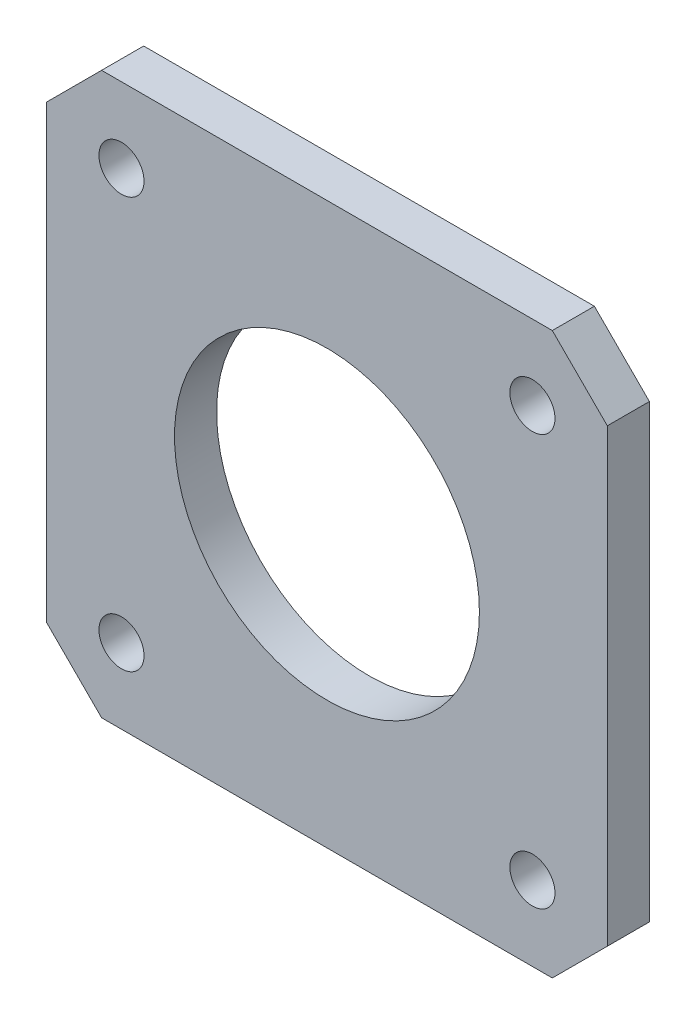
ISO-10303-21;
HEADER;
FILE_DESCRIPTION(('STEP AP214'),'2;1');
FILE_NAME('part.step','',(''),(''),'','','');
FILE_SCHEMA(('AUTOMOTIVE_DESIGN { 1 0 10303 214 1 1 1 1 }'));
ENDSEC;
DATA;
#1=APPLICATION_CONTEXT('core data for automotive mechanical design processes');
#2=APPLICATION_PROTOCOL_DEFINITION('international standard','automotive_design',2000,#1);
#3=PRODUCT_CONTEXT('',#1,'mechanical');
#4=PRODUCT('Part','Part','',(#3));
#5=PRODUCT_RELATED_PRODUCT_CATEGORY('part','',(#4));
#6=PRODUCT_DEFINITION_FORMATION('','',#4);
#7=PRODUCT_DEFINITION_CONTEXT('part definition',#1,'design');
#8=PRODUCT_DEFINITION('design','',#6,#7);
#9=PRODUCT_DEFINITION_SHAPE('','',#8);
#10=(LENGTH_UNIT() NAMED_UNIT(*) SI_UNIT(.MILLI.,.METRE.));
#11=(NAMED_UNIT(*) PLANE_ANGLE_UNIT() SI_UNIT($,.RADIAN.));
#12=(NAMED_UNIT(*) SI_UNIT($,.STERADIAN.) SOLID_ANGLE_UNIT());
#13=UNCERTAINTY_MEASURE_WITH_UNIT(LENGTH_MEASURE(1.E-05),#10,'distance_accuracy_value','');
#14=(GEOMETRIC_REPRESENTATION_CONTEXT(3) GLOBAL_UNCERTAINTY_ASSIGNED_CONTEXT((#13)) GLOBAL_UNIT_ASSIGNED_CONTEXT((#10,
#11,#12)) REPRESENTATION_CONTEXT('',''));
#15=CARTESIAN_POINT('',(0.,0.,0.));
#16=DIRECTION('',(0.,0.,1.));
#17=DIRECTION('',(1.,0.,0.));
#18=AXIS2_PLACEMENT_3D('',#15,#16,#17);
#19=CARTESIAN_POINT('',(0.,0.,3.175));
#20=DIRECTION('',(0.,0.,-1.));
#21=DIRECTION('',(-1.,0.,0.));
#22=AXIS2_PLACEMENT_3D('',#19,#20,#21);
#23=PLANE('',#22);
#24=CARTESIAN_POINT('',(15.5,15.5,3.175));
#25=DIRECTION('',(0.,0.,1.));
#26=DIRECTION('',(1.,0.,0.));
#27=AXIS2_PLACEMENT_3D('',#24,#25,#26);
#28=CIRCLE('',#27,1.7);
#29=CARTESIAN_POINT('',(17.2,15.5,3.175));
#30=VERTEX_POINT('',#29);
#31=EDGE_CURVE('E201',#30,#30,#28,.T.);
#32=ORIENTED_EDGE('',*,*,#31,.F.);
#33=EDGE_LOOP('',(#32));
#34=FACE_BOUND('',#33,.T.);
#35=CARTESIAN_POINT('',(-15.5,-15.5,3.175));
#36=DIRECTION('',(0.,0.,1.));
#37=DIRECTION('',(1.,0.,0.));
#38=AXIS2_PLACEMENT_3D('',#35,#36,#37);
#39=CIRCLE('',#38,1.7);
#40=CARTESIAN_POINT('',(-13.8,-15.5,3.175));
#41=VERTEX_POINT('',#40);
#42=EDGE_CURVE('E189',#41,#41,#39,.T.);
#43=ORIENTED_EDGE('',*,*,#42,.F.);
#44=EDGE_LOOP('',(#43));
#45=FACE_BOUND('',#44,.T.);
#46=CARTESIAN_POINT('',(0.,0.,3.175));
#47=DIRECTION('',(0.,0.,1.));
#48=DIRECTION('',(1.,0.,0.));
#49=AXIS2_PLACEMENT_3D('',#46,#47,#48);
#50=CIRCLE('',#49,11.5);
#51=CARTESIAN_POINT('',(11.5,0.,3.175));
#52=VERTEX_POINT('',#51);
#53=EDGE_CURVE('E181',#52,#52,#50,.T.);
#54=ORIENTED_EDGE('',*,*,#53,.F.);
#55=EDGE_LOOP('',(#54));
#56=FACE_BOUND('',#55,.T.);
#57=DIRECTION('',(-0.707106781186549,-0.707106781186546,0.));
#58=VECTOR('',#57,1.);
#59=CARTESIAN_POINT('',(-21.15,17.,3.175));
#60=LINE('',#59,#58);
#61=CARTESIAN_POINT('',(-17.,21.15,3.175));
#62=VERTEX_POINT('',#61);
#63=CARTESIAN_POINT('',(-21.15,17.,3.175));
#64=VERTEX_POINT('',#63);
#65=EDGE_CURVE('E148',#62,#64,#60,.T.);
#66=ORIENTED_EDGE('',*,*,#65,.T.);
#67=DIRECTION('',(0.,-1.,0.));
#68=VECTOR('',#67,1.);
#69=CARTESIAN_POINT('',(-21.15,-17.,3.175));
#70=LINE('',#69,#68);
#71=CARTESIAN_POINT('',(-21.15,-17.,3.175));
#72=VERTEX_POINT('',#71);
#73=EDGE_CURVE('E96',#64,#72,#70,.T.);
#74=ORIENTED_EDGE('',*,*,#73,.T.);
#75=DIRECTION('',(0.707106781186549,-0.707106781186546,0.));
#76=VECTOR('',#75,1.);
#77=CARTESIAN_POINT('',(-17.,-21.15,3.175));
#78=LINE('',#77,#76);
#79=CARTESIAN_POINT('',(-17.,-21.15,3.175));
#80=VERTEX_POINT('',#79);
#81=EDGE_CURVE('E163',#72,#80,#78,.T.);
#82=ORIENTED_EDGE('',*,*,#81,.T.);
#83=DIRECTION('',(1.,0.,0.));
#84=VECTOR('',#83,1.);
#85=CARTESIAN_POINT('',(-17.,-21.15,3.175));
#86=LINE('',#85,#84);
#87=CARTESIAN_POINT('',(17.,-21.15,3.175));
#88=VERTEX_POINT('',#87);
#89=EDGE_CURVE('E175',#80,#88,#86,.T.);
#90=ORIENTED_EDGE('',*,*,#89,.T.);
#91=DIRECTION('',(0.707106781186548,0.707106781186547,0.));
#92=VECTOR('',#91,1.);
#93=CARTESIAN_POINT('',(21.15,-17.,3.175));
#94=LINE('',#93,#92);
#95=CARTESIAN_POINT('',(21.15,-17.,3.175));
#96=VERTEX_POINT('',#95);
#97=EDGE_CURVE('E115',#88,#96,#94,.T.);
#98=ORIENTED_EDGE('',*,*,#97,.T.);
#99=DIRECTION('',(0.,1.,0.));
#100=VECTOR('',#99,1.);
#101=CARTESIAN_POINT('',(21.15,-17.,3.175));
#102=LINE('',#101,#100);
#103=CARTESIAN_POINT('',(21.15,17.,3.175));
#104=VERTEX_POINT('',#103);
#105=EDGE_CURVE('E109',#96,#104,#102,.T.);
#106=ORIENTED_EDGE('',*,*,#105,.T.);
#107=DIRECTION('',(-0.707106781186549,0.707106781186546,0.));
#108=VECTOR('',#107,1.);
#109=CARTESIAN_POINT('',(17.,21.15,3.175));
#110=LINE('',#109,#108);
#111=CARTESIAN_POINT('',(17.,21.15,3.175));
#112=VERTEX_POINT('',#111);
#113=EDGE_CURVE('E113',#104,#112,#110,.T.);
#114=ORIENTED_EDGE('',*,*,#113,.T.);
#115=DIRECTION('',(-1.,0.,0.));
#116=VECTOR('',#115,1.);
#117=CARTESIAN_POINT('',(-17.,21.15,3.175));
#118=LINE('',#117,#116);
#119=EDGE_CURVE('E53',#112,#62,#118,.T.);
#120=ORIENTED_EDGE('',*,*,#119,.T.);
#121=EDGE_LOOP('',(#66,#74,#82,#90,#98,#106,#114,#120));
#122=FACE_BOUND('',#121,.T.);
#123=CARTESIAN_POINT('',(15.5,-15.5,3.175));
#124=DIRECTION('',(0.,0.,1.));
#125=DIRECTION('',(1.,0.,0.));
#126=AXIS2_PLACEMENT_3D('',#123,#124,#125);
#127=CIRCLE('',#126,1.7);
#128=CARTESIAN_POINT('',(17.2,-15.5,3.175));
#129=VERTEX_POINT('',#128);
#130=EDGE_CURVE('E195',#129,#129,#127,.T.);
#131=ORIENTED_EDGE('',*,*,#130,.F.);
#132=EDGE_LOOP('',(#131));
#133=FACE_BOUND('',#132,.T.);
#134=CARTESIAN_POINT('',(-15.5,15.5,3.175));
#135=DIRECTION('',(0.,0.,1.));
#136=DIRECTION('',(1.,0.,0.));
#137=AXIS2_PLACEMENT_3D('',#134,#135,#136);
#138=CIRCLE('',#137,1.7);
#139=CARTESIAN_POINT('',(-13.8,15.5,3.175));
#140=VERTEX_POINT('',#139);
#141=EDGE_CURVE('E207',#140,#140,#138,.T.);
#142=ORIENTED_EDGE('',*,*,#141,.F.);
#143=EDGE_LOOP('',(#142));
#144=FACE_BOUND('',#143,.T.);
#145=ADVANCED_FACE('F36',(#34,#45,#56,#122,#133,#144),#23,.F.);
#146=CARTESIAN_POINT('',(-21.15,17.,3.175));
#147=DIRECTION('',(0.707106781186546,-0.707106781186549,0.));
#148=DIRECTION('',(0.707106781186549,0.707106781186546,0.));
#149=AXIS2_PLACEMENT_3D('',#146,#147,#148);
#150=PLANE('',#149);
#151=DIRECTION('',(-0.707106781186549,-0.707106781186546,0.));
#152=VECTOR('',#151,1.);
#153=CARTESIAN_POINT('',(-21.15,17.,0.));
#154=LINE('',#153,#152);
#155=CARTESIAN_POINT('',(-17.,21.15,0.));
#156=VERTEX_POINT('',#155);
#157=CARTESIAN_POINT('',(-21.15,17.,0.));
#158=VERTEX_POINT('',#157);
#159=EDGE_CURVE('E133',#156,#158,#154,.T.);
#160=ORIENTED_EDGE('',*,*,#159,.T.);
#161=DIRECTION('',(0.,0.,-1.));
#162=VECTOR('',#161,1.);
#163=CARTESIAN_POINT('',(-21.15,17.,3.175));
#164=LINE('',#163,#162);
#165=EDGE_CURVE('E11',#64,#158,#164,.T.);
#166=ORIENTED_EDGE('',*,*,#165,.F.);
#167=ORIENTED_EDGE('',*,*,#65,.F.);
#168=DIRECTION('',(0.,0.,-1.));
#169=VECTOR('',#168,1.);
#170=CARTESIAN_POINT('',(-17.,21.15,3.175));
#171=LINE('',#170,#169);
#172=EDGE_CURVE('E129',#62,#156,#171,.T.);
#173=ORIENTED_EDGE('',*,*,#172,.T.);
#174=EDGE_LOOP('',(#160,#166,#167,#173));
#175=FACE_BOUND('',#174,.T.);
#176=ADVANCED_FACE('F38',(#175),#150,.F.);
#177=CARTESIAN_POINT('',(-21.15,-17.,3.175));
#178=DIRECTION('',(1.,0.,0.));
#179=DIRECTION('',(0.,1.,0.));
#180=AXIS2_PLACEMENT_3D('',#177,#178,#179);
#181=PLANE('',#180);
#182=DIRECTION('',(0.,-1.,0.));
#183=VECTOR('',#182,1.);
#184=CARTESIAN_POINT('',(-21.15,-17.,0.));
#185=LINE('',#184,#183);
#186=CARTESIAN_POINT('',(-21.15,-17.,0.));
#187=VERTEX_POINT('',#186);
#188=EDGE_CURVE('E136',#158,#187,#185,.T.);
#189=ORIENTED_EDGE('',*,*,#188,.T.);
#190=DIRECTION('',(0.,0.,-1.));
#191=VECTOR('',#190,1.);
#192=CARTESIAN_POINT('',(-21.15,-17.,3.175));
#193=LINE('',#192,#191);
#194=EDGE_CURVE('E45',#72,#187,#193,.T.);
#195=ORIENTED_EDGE('',*,*,#194,.F.);
#196=ORIENTED_EDGE('',*,*,#73,.F.);
#197=ORIENTED_EDGE('',*,*,#165,.T.);
#198=EDGE_LOOP('',(#189,#195,#196,#197));
#199=FACE_BOUND('',#198,.T.);
#200=ADVANCED_FACE('F220',(#199),#181,.F.);
#201=CARTESIAN_POINT('',(-17.,-21.15,3.175));
#202=DIRECTION('',(0.707106781186546,0.707106781186549,0.));
#203=DIRECTION('',(-0.707106781186549,0.707106781186546,0.));
#204=AXIS2_PLACEMENT_3D('',#201,#202,#203);
#205=PLANE('',#204);
#206=DIRECTION('',(0.707106781186549,-0.707106781186546,0.));
#207=VECTOR('',#206,1.);
#208=CARTESIAN_POINT('',(-17.,-21.15,0.));
#209=LINE('',#208,#207);
#210=CARTESIAN_POINT('',(-17.,-21.15,0.));
#211=VERTEX_POINT('',#210);
#212=EDGE_CURVE('E139',#187,#211,#209,.T.);
#213=ORIENTED_EDGE('',*,*,#212,.T.);
#214=DIRECTION('',(0.,0.,-1.));
#215=VECTOR('',#214,1.);
#216=CARTESIAN_POINT('',(-17.,-21.15,3.175));
#217=LINE('',#216,#215);
#218=EDGE_CURVE('E155',#80,#211,#217,.T.);
#219=ORIENTED_EDGE('',*,*,#218,.F.);
#220=ORIENTED_EDGE('',*,*,#81,.F.);
#221=ORIENTED_EDGE('',*,*,#194,.T.);
#222=EDGE_LOOP('',(#213,#219,#220,#221));
#223=FACE_BOUND('',#222,.T.);
#224=ADVANCED_FACE('F161',(#223),#205,.F.);
#225=CARTESIAN_POINT('',(-17.,-21.15,3.175));
#226=DIRECTION('',(0.,1.,0.));
#227=DIRECTION('',(-1.,0.,0.));
#228=AXIS2_PLACEMENT_3D('',#225,#226,#227);
#229=PLANE('',#228);
#230=DIRECTION('',(1.,0.,0.));
#231=VECTOR('',#230,1.);
#232=CARTESIAN_POINT('',(-17.,-21.15,0.));
#233=LINE('',#232,#231);
#234=CARTESIAN_POINT('',(17.,-21.15,0.));
#235=VERTEX_POINT('',#234);
#236=EDGE_CURVE('E141',#211,#235,#233,.T.);
#237=ORIENTED_EDGE('',*,*,#236,.T.);
#238=DIRECTION('',(0.,0.,-1.));
#239=VECTOR('',#238,1.);
#240=CARTESIAN_POINT('',(17.,-21.15,3.175));
#241=LINE('',#240,#239);
#242=EDGE_CURVE('E152',#88,#235,#241,.T.);
#243=ORIENTED_EDGE('',*,*,#242,.F.);
#244=ORIENTED_EDGE('',*,*,#89,.F.);
#245=ORIENTED_EDGE('',*,*,#218,.T.);
#246=EDGE_LOOP('',(#237,#243,#244,#245));
#247=FACE_BOUND('',#246,.T.);
#248=ADVANCED_FACE('F171',(#247),#229,.F.);
#249=CARTESIAN_POINT('',(21.15,-17.,3.175));
#250=DIRECTION('',(-0.707106781186547,0.707106781186548,0.));
#251=DIRECTION('',(-0.707106781186548,-0.707106781186547,0.));
#252=AXIS2_PLACEMENT_3D('',#249,#250,#251);
#253=PLANE('',#252);
#254=DIRECTION('',(0.707106781186548,0.707106781186547,0.));
#255=VECTOR('',#254,1.);
#256=CARTESIAN_POINT('',(21.15,-17.,0.));
#257=LINE('',#256,#255);
#258=CARTESIAN_POINT('',(21.15,-17.,0.));
#259=VERTEX_POINT('',#258);
#260=EDGE_CURVE('E143',#235,#259,#257,.T.);
#261=ORIENTED_EDGE('',*,*,#260,.T.);
#262=DIRECTION('',(0.,0.,-1.));
#263=VECTOR('',#262,1.);
#264=CARTESIAN_POINT('',(21.15,-17.,3.175));
#265=LINE('',#264,#263);
#266=EDGE_CURVE('E124',#96,#259,#265,.T.);
#267=ORIENTED_EDGE('',*,*,#266,.F.);
#268=ORIENTED_EDGE('',*,*,#97,.F.);
#269=ORIENTED_EDGE('',*,*,#242,.T.);
#270=EDGE_LOOP('',(#261,#267,#268,#269));
#271=FACE_BOUND('',#270,.T.);
#272=ADVANCED_FACE('F174',(#271),#253,.F.);
#273=CARTESIAN_POINT('',(21.15,-17.,3.175));
#274=DIRECTION('',(-1.,0.,0.));
#275=DIRECTION('',(0.,-1.,0.));
#276=AXIS2_PLACEMENT_3D('',#273,#274,#275);
#277=PLANE('',#276);
#278=DIRECTION('',(0.,1.,0.));
#279=VECTOR('',#278,1.);
#280=CARTESIAN_POINT('',(21.15,-17.,0.));
#281=LINE('',#280,#279);
#282=CARTESIAN_POINT('',(21.15,17.,0.));
#283=VERTEX_POINT('',#282);
#284=EDGE_CURVE('E123',#259,#283,#281,.T.);
#285=ORIENTED_EDGE('',*,*,#284,.T.);
#286=DIRECTION('',(0.,0.,-1.));
#287=VECTOR('',#286,1.);
#288=CARTESIAN_POINT('',(21.15,17.,3.175));
#289=LINE('',#288,#287);
#290=EDGE_CURVE('E120',#104,#283,#289,.T.);
#291=ORIENTED_EDGE('',*,*,#290,.F.);
#292=ORIENTED_EDGE('',*,*,#105,.F.);
#293=ORIENTED_EDGE('',*,*,#266,.T.);
#294=EDGE_LOOP('',(#285,#291,#292,#293));
#295=FACE_BOUND('',#294,.T.);
#296=ADVANCED_FACE('F121',(#295),#277,.F.);
#297=CARTESIAN_POINT('',(17.,21.15,3.175));
#298=DIRECTION('',(-0.707106781186546,-0.707106781186549,0.));
#299=DIRECTION('',(0.707106781186549,-0.707106781186546,0.));
#300=AXIS2_PLACEMENT_3D('',#297,#298,#299);
#301=PLANE('',#300);
#302=DIRECTION('',(-0.707106781186549,0.707106781186546,0.));
#303=VECTOR('',#302,1.);
#304=CARTESIAN_POINT('',(17.,21.15,0.));
#305=LINE('',#304,#303);
#306=CARTESIAN_POINT('',(17.,21.15,0.));
#307=VERTEX_POINT('',#306);
#308=EDGE_CURVE('E82',#283,#307,#305,.T.);
#309=ORIENTED_EDGE('',*,*,#308,.T.);
#310=DIRECTION('',(0.,0.,-1.));
#311=VECTOR('',#310,1.);
#312=CARTESIAN_POINT('',(17.,21.15,3.175));
#313=LINE('',#312,#311);
#314=EDGE_CURVE('E125',#112,#307,#313,.T.);
#315=ORIENTED_EDGE('',*,*,#314,.F.);
#316=ORIENTED_EDGE('',*,*,#113,.F.);
#317=ORIENTED_EDGE('',*,*,#290,.T.);
#318=EDGE_LOOP('',(#309,#315,#316,#317));
#319=FACE_BOUND('',#318,.T.);
#320=ADVANCED_FACE('F127',(#319),#301,.F.);
#321=CARTESIAN_POINT('',(-17.,21.15,3.175));
#322=DIRECTION('',(0.,-1.,0.));
#323=DIRECTION('',(1.,0.,0.));
#324=AXIS2_PLACEMENT_3D('',#321,#322,#323);
#325=PLANE('',#324);
#326=DIRECTION('',(-1.,0.,0.));
#327=VECTOR('',#326,1.);
#328=CARTESIAN_POINT('',(-17.,21.15,0.));
#329=LINE('',#328,#327);
#330=EDGE_CURVE('E88',#307,#156,#329,.T.);
#331=ORIENTED_EDGE('',*,*,#330,.T.);
#332=ORIENTED_EDGE('',*,*,#172,.F.);
#333=ORIENTED_EDGE('',*,*,#119,.F.);
#334=ORIENTED_EDGE('',*,*,#314,.T.);
#335=EDGE_LOOP('',(#331,#332,#333,#334));
#336=FACE_BOUND('',#335,.T.);
#337=ADVANCED_FACE('F230',(#336),#325,.F.);
#338=CARTESIAN_POINT('',(0.,0.,0.));
#339=DIRECTION('',(0.,0.,-1.));
#340=DIRECTION('',(-1.,0.,0.));
#341=AXIS2_PLACEMENT_3D('',#338,#339,#340);
#342=PLANE('',#341);
#343=CARTESIAN_POINT('',(-15.5,15.5,0.));
#344=DIRECTION('',(0.,0.,-1.));
#345=DIRECTION('',(-1.,0.,0.));
#346=AXIS2_PLACEMENT_3D('',#343,#344,#345);
#347=CIRCLE('',#346,1.7);
#348=CARTESIAN_POINT('',(-17.2,15.5,0.));
#349=VERTEX_POINT('',#348);
#350=EDGE_CURVE('E204',#349,#349,#347,.T.);
#351=ORIENTED_EDGE('',*,*,#350,.F.);
#352=EDGE_LOOP('',(#351));
#353=FACE_BOUND('',#352,.T.);
#354=CARTESIAN_POINT('',(15.5,15.5,0.));
#355=DIRECTION('',(0.,0.,-1.));
#356=DIRECTION('',(-1.,0.,0.));
#357=AXIS2_PLACEMENT_3D('',#354,#355,#356);
#358=CIRCLE('',#357,1.7);
#359=CARTESIAN_POINT('',(13.8,15.5,0.));
#360=VERTEX_POINT('',#359);
#361=EDGE_CURVE('E198',#360,#360,#358,.T.);
#362=ORIENTED_EDGE('',*,*,#361,.F.);
#363=EDGE_LOOP('',(#362));
#364=FACE_BOUND('',#363,.T.);
#365=CARTESIAN_POINT('',(15.5,-15.5,0.));
#366=DIRECTION('',(0.,0.,-1.));
#367=DIRECTION('',(-1.,0.,0.));
#368=AXIS2_PLACEMENT_3D('',#365,#366,#367);
#369=CIRCLE('',#368,1.7);
#370=CARTESIAN_POINT('',(13.8,-15.5,0.));
#371=VERTEX_POINT('',#370);
#372=EDGE_CURVE('E192',#371,#371,#369,.T.);
#373=ORIENTED_EDGE('',*,*,#372,.F.);
#374=EDGE_LOOP('',(#373));
#375=FACE_BOUND('',#374,.T.);
#376=CARTESIAN_POINT('',(-15.5,-15.5,0.));
#377=DIRECTION('',(0.,0.,-1.));
#378=DIRECTION('',(-1.,0.,0.));
#379=AXIS2_PLACEMENT_3D('',#376,#377,#378);
#380=CIRCLE('',#379,1.7);
#381=CARTESIAN_POINT('',(-17.2,-15.5,0.));
#382=VERTEX_POINT('',#381);
#383=EDGE_CURVE('E184',#382,#382,#380,.T.);
#384=ORIENTED_EDGE('',*,*,#383,.F.);
#385=EDGE_LOOP('',(#384));
#386=FACE_BOUND('',#385,.T.);
#387=CARTESIAN_POINT('',(0.,0.,0.));
#388=DIRECTION('',(0.,0.,1.));
#389=DIRECTION('',(1.,0.,0.));
#390=AXIS2_PLACEMENT_3D('',#387,#388,#389);
#391=CIRCLE('',#390,11.5);
#392=CARTESIAN_POINT('',(11.5,0.,0.));
#393=VERTEX_POINT('',#392);
#394=EDGE_CURVE('E137',#393,#393,#391,.T.);
#395=ORIENTED_EDGE('',*,*,#394,.T.);
#396=EDGE_LOOP('',(#395));
#397=FACE_BOUND('',#396,.T.);
#398=ORIENTED_EDGE('',*,*,#159,.F.);
#399=ORIENTED_EDGE('',*,*,#330,.F.);
#400=ORIENTED_EDGE('',*,*,#308,.F.);
#401=ORIENTED_EDGE('',*,*,#284,.F.);
#402=ORIENTED_EDGE('',*,*,#260,.F.);
#403=ORIENTED_EDGE('',*,*,#236,.F.);
#404=ORIENTED_EDGE('',*,*,#212,.F.);
#405=ORIENTED_EDGE('',*,*,#188,.F.);
#406=EDGE_LOOP('',(#398,#399,#400,#401,#402,#403,#404,#405));
#407=FACE_BOUND('',#406,.T.);
#408=ADVANCED_FACE('F167',(#353,#364,#375,#386,#397,#407),#342,.T.);
#409=CARTESIAN_POINT('',(0.,0.,0.));
#410=DIRECTION('',(0.,0.,1.));
#411=DIRECTION('',(1.,0.,0.));
#412=AXIS2_PLACEMENT_3D('',#409,#410,#411);
#413=CYLINDRICAL_SURFACE('',#412,11.5);
#414=ORIENTED_EDGE('',*,*,#394,.F.);
#415=EDGE_LOOP('',(#414));
#416=FACE_BOUND('',#415,.T.);
#417=ORIENTED_EDGE('',*,*,#53,.T.);
#418=EDGE_LOOP('',(#417));
#419=FACE_BOUND('',#418,.T.);
#420=ADVANCED_FACE('F226',(#416,#419),#413,.F.);
#421=CARTESIAN_POINT('',(-15.5,-15.5,3.175));
#422=DIRECTION('',(0.,0.,1.));
#423=DIRECTION('',(1.,0.,0.));
#424=AXIS2_PLACEMENT_3D('',#421,#422,#423);
#425=CYLINDRICAL_SURFACE('',#424,1.7);
#426=ORIENTED_EDGE('',*,*,#42,.T.);
#427=EDGE_LOOP('',(#426));
#428=FACE_BOUND('',#427,.T.);
#429=ORIENTED_EDGE('',*,*,#383,.T.);
#430=EDGE_LOOP('',(#429));
#431=FACE_BOUND('',#430,.T.);
#432=ADVANCED_FACE('F285',(#428,#431),#425,.F.);
#433=CARTESIAN_POINT('',(15.5,-15.5,3.175));
#434=DIRECTION('',(0.,0.,1.));
#435=DIRECTION('',(1.,0.,0.));
#436=AXIS2_PLACEMENT_3D('',#433,#434,#435);
#437=CYLINDRICAL_SURFACE('',#436,1.7);
#438=ORIENTED_EDGE('',*,*,#130,.T.);
#439=EDGE_LOOP('',(#438));
#440=FACE_BOUND('',#439,.T.);
#441=ORIENTED_EDGE('',*,*,#372,.T.);
#442=EDGE_LOOP('',(#441));
#443=FACE_BOUND('',#442,.T.);
#444=ADVANCED_FACE('F291',(#440,#443),#437,.F.);
#445=CARTESIAN_POINT('',(15.5,15.5,3.175));
#446=DIRECTION('',(0.,0.,1.));
#447=DIRECTION('',(1.,0.,0.));
#448=AXIS2_PLACEMENT_3D('',#445,#446,#447);
#449=CYLINDRICAL_SURFACE('',#448,1.7);
#450=ORIENTED_EDGE('',*,*,#31,.T.);
#451=EDGE_LOOP('',(#450));
#452=FACE_BOUND('',#451,.T.);
#453=ORIENTED_EDGE('',*,*,#361,.T.);
#454=EDGE_LOOP('',(#453));
#455=FACE_BOUND('',#454,.T.);
#456=ADVANCED_FACE('F298',(#452,#455),#449,.F.);
#457=CARTESIAN_POINT('',(-15.5,15.5,3.175));
#458=DIRECTION('',(0.,0.,1.));
#459=DIRECTION('',(1.,0.,0.));
#460=AXIS2_PLACEMENT_3D('',#457,#458,#459);
#461=CYLINDRICAL_SURFACE('',#460,1.7);
#462=ORIENTED_EDGE('',*,*,#141,.T.);
#463=EDGE_LOOP('',(#462));
#464=FACE_BOUND('',#463,.T.);
#465=ORIENTED_EDGE('',*,*,#350,.T.);
#466=EDGE_LOOP('',(#465));
#467=FACE_BOUND('',#466,.T.);
#468=ADVANCED_FACE('F211',(#464,#467),#461,.F.);
#469=CLOSED_SHELL('',(#145,#176,#200,#224,#248,#272,#296,#320,#337,#408,#420,#432,#444,#456,#468));
#470=MANIFOLD_SOLID_BREP('B2',#469);
#471=ADVANCED_BREP_SHAPE_REPRESENTATION('',(#18,#470),#14);
#472=SHAPE_DEFINITION_REPRESENTATION(#9,#471);
ENDSEC;
END-ISO-10303-21;
